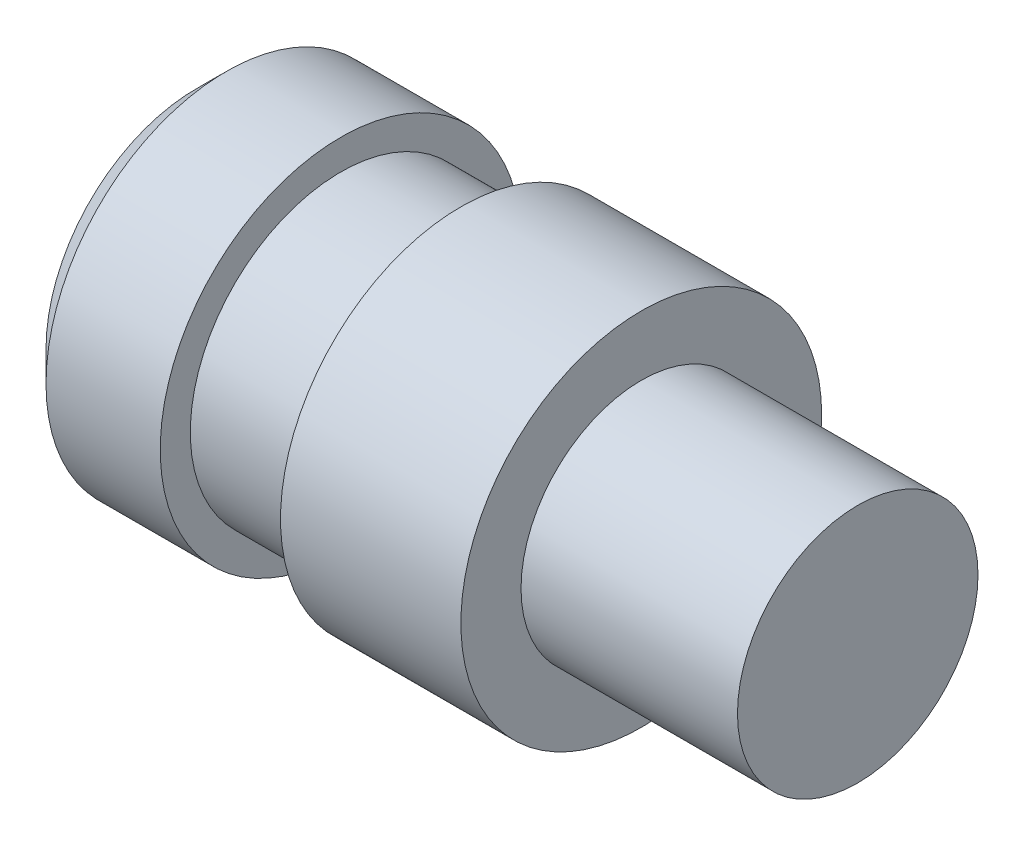
ISO-10303-21;
HEADER;
FILE_DESCRIPTION(('STEP AP214'),'2;1');
FILE_NAME('part.step','',(''),(''),'','','');
FILE_SCHEMA(('AUTOMOTIVE_DESIGN { 1 0 10303 214 1 1 1 1 }'));
ENDSEC;
DATA;
#1=APPLICATION_CONTEXT('core data for automotive mechanical design processes');
#2=APPLICATION_PROTOCOL_DEFINITION('international standard','automotive_design',2000,#1);
#3=PRODUCT_CONTEXT('',#1,'mechanical');
#4=PRODUCT('Part','Part','',(#3));
#5=PRODUCT_RELATED_PRODUCT_CATEGORY('part','',(#4));
#6=PRODUCT_DEFINITION_FORMATION('','',#4);
#7=PRODUCT_DEFINITION_CONTEXT('part definition',#1,'design');
#8=PRODUCT_DEFINITION('design','',#6,#7);
#9=PRODUCT_DEFINITION_SHAPE('','',#8);
#10=(LENGTH_UNIT() NAMED_UNIT(*) SI_UNIT(.MILLI.,.METRE.));
#11=(NAMED_UNIT(*) PLANE_ANGLE_UNIT() SI_UNIT($,.RADIAN.));
#12=(NAMED_UNIT(*) SI_UNIT($,.STERADIAN.) SOLID_ANGLE_UNIT());
#13=UNCERTAINTY_MEASURE_WITH_UNIT(LENGTH_MEASURE(1.E-05),#10,'distance_accuracy_value','');
#14=(GEOMETRIC_REPRESENTATION_CONTEXT(3) GLOBAL_UNCERTAINTY_ASSIGNED_CONTEXT((#13)) GLOBAL_UNIT_ASSIGNED_CONTEXT((#10,
#11,#12)) REPRESENTATION_CONTEXT('',''));
#15=CARTESIAN_POINT('',(0.,0.,0.));
#16=DIRECTION('',(0.,0.,1.));
#17=DIRECTION('',(1.,0.,0.));
#18=AXIS2_PLACEMENT_3D('',#15,#16,#17);
#19=CARTESIAN_POINT('',(0.,0.,0.));
#20=DIRECTION('',(-1.,0.,0.));
#21=DIRECTION('',(0.,0.,1.));
#22=AXIS2_PLACEMENT_3D('',#19,#20,#21);
#23=PLANE('',#22);
#24=CARTESIAN_POINT('',(0.,0.,0.));
#25=DIRECTION('',(-1.,0.,0.));
#26=DIRECTION('',(0.,0.,1.));
#27=AXIS2_PLACEMENT_3D('',#24,#25,#26);
#28=CIRCLE('',#27,2.5);
#29=CARTESIAN_POINT('',(0.,0.,2.5));
#30=VERTEX_POINT('',#29);
#31=EDGE_CURVE('E10',#30,#30,#28,.T.);
#32=ORIENTED_EDGE('',*,*,#31,.T.);
#33=EDGE_LOOP('',(#32));
#34=FACE_BOUND('',#33,.T.);
#35=ADVANCED_FACE('F35',(#34),#23,.T.);
#36=CARTESIAN_POINT('',(11.,0.,0.));
#37=DIRECTION('',(1.,0.,0.));
#38=DIRECTION('',(0.,0.,-1.));
#39=AXIS2_PLACEMENT_3D('',#36,#37,#38);
#40=CYLINDRICAL_SURFACE('',#39,3.);
#41=CARTESIAN_POINT('',(0.499999999999999,0.,0.));
#42=DIRECTION('',(-1.,0.,0.));
#43=DIRECTION('',(0.,0.,1.));
#44=AXIS2_PLACEMENT_3D('',#41,#42,#43);
#45=CIRCLE('',#44,3.);
#46=CARTESIAN_POINT('',(0.499999999999999,0.,3.));
#47=VERTEX_POINT('',#46);
#48=EDGE_CURVE('E42',#47,#47,#45,.F.);
#49=ORIENTED_EDGE('',*,*,#48,.T.);
#50=EDGE_LOOP('',(#49));
#51=FACE_BOUND('',#50,.T.);
#52=CARTESIAN_POINT('',(2.4,0.,0.));
#53=DIRECTION('',(1.,0.,0.));
#54=DIRECTION('',(0.,0.,-1.));
#55=AXIS2_PLACEMENT_3D('',#52,#53,#54);
#56=CIRCLE('',#55,3.);
#57=CARTESIAN_POINT('',(2.4,0.,-3.));
#58=VERTEX_POINT('',#57);
#59=EDGE_CURVE('E46',#58,#58,#56,.T.);
#60=ORIENTED_EDGE('',*,*,#59,.F.);
#61=EDGE_LOOP('',(#60));
#62=FACE_BOUND('',#61,.T.);
#63=ADVANCED_FACE('F87',(#51,#62),#40,.T.);
#64=CARTESIAN_POINT('',(2.4,3.,0.));
#65=DIRECTION('',(1.,0.,0.));
#66=DIRECTION('',(0.,0.,-1.));
#67=AXIS2_PLACEMENT_3D('',#64,#65,#66);
#68=PLANE('',#67);
#69=ORIENTED_EDGE('',*,*,#59,.T.);
#70=EDGE_LOOP('',(#69));
#71=FACE_BOUND('',#70,.T.);
#72=CARTESIAN_POINT('',(2.4,0.,0.));
#73=DIRECTION('',(1.,0.,0.));
#74=DIRECTION('',(0.,0.,-1.));
#75=AXIS2_PLACEMENT_3D('',#72,#73,#74);
#76=CIRCLE('',#75,2.5);
#77=CARTESIAN_POINT('',(2.4,0.,-2.5));
#78=VERTEX_POINT('',#77);
#79=EDGE_CURVE('E50',#78,#78,#76,.T.);
#80=ORIENTED_EDGE('',*,*,#79,.F.);
#81=EDGE_LOOP('',(#80));
#82=FACE_BOUND('',#81,.T.);
#83=ADVANCED_FACE('F91',(#71,#82),#68,.T.);
#84=CARTESIAN_POINT('',(11.,0.,0.));
#85=DIRECTION('',(1.,0.,0.));
#86=DIRECTION('',(0.,0.,-1.));
#87=AXIS2_PLACEMENT_3D('',#84,#85,#86);
#88=CYLINDRICAL_SURFACE('',#87,2.5);
#89=ORIENTED_EDGE('',*,*,#79,.T.);
#90=EDGE_LOOP('',(#89));
#91=FACE_BOUND('',#90,.T.);
#92=CARTESIAN_POINT('',(4.4,0.,0.));
#93=DIRECTION('',(1.,0.,0.));
#94=DIRECTION('',(0.,0.,-1.));
#95=AXIS2_PLACEMENT_3D('',#92,#93,#94);
#96=CIRCLE('',#95,2.5);
#97=CARTESIAN_POINT('',(4.4,0.,-2.5));
#98=VERTEX_POINT('',#97);
#99=EDGE_CURVE('E55',#98,#98,#96,.T.);
#100=ORIENTED_EDGE('',*,*,#99,.F.);
#101=EDGE_LOOP('',(#100));
#102=FACE_BOUND('',#101,.T.);
#103=ADVANCED_FACE('F96',(#91,#102),#88,.T.);
#104=CARTESIAN_POINT('',(4.4,2.5,0.));
#105=DIRECTION('',(-1.,0.,0.));
#106=DIRECTION('',(0.,0.,1.));
#107=AXIS2_PLACEMENT_3D('',#104,#105,#106);
#108=PLANE('',#107);
#109=ORIENTED_EDGE('',*,*,#99,.T.);
#110=EDGE_LOOP('',(#109));
#111=FACE_BOUND('',#110,.T.);
#112=CARTESIAN_POINT('',(4.4,0.,0.));
#113=DIRECTION('',(1.,0.,0.));
#114=DIRECTION('',(0.,0.,-1.));
#115=AXIS2_PLACEMENT_3D('',#112,#113,#114);
#116=CIRCLE('',#115,3.);
#117=CARTESIAN_POINT('',(4.4,0.,-3.));
#118=VERTEX_POINT('',#117);
#119=EDGE_CURVE('E58',#118,#118,#116,.T.);
#120=ORIENTED_EDGE('',*,*,#119,.F.);
#121=EDGE_LOOP('',(#120));
#122=FACE_BOUND('',#121,.T.);
#123=ADVANCED_FACE('F100',(#111,#122),#108,.T.);
#124=CARTESIAN_POINT('',(11.,0.,0.));
#125=DIRECTION('',(1.,0.,0.));
#126=DIRECTION('',(0.,0.,-1.));
#127=AXIS2_PLACEMENT_3D('',#124,#125,#126);
#128=CYLINDRICAL_SURFACE('',#127,3.);
#129=ORIENTED_EDGE('',*,*,#119,.T.);
#130=EDGE_LOOP('',(#129));
#131=FACE_BOUND('',#130,.T.);
#132=CARTESIAN_POINT('',(7.4,0.,0.));
#133=DIRECTION('',(1.,0.,0.));
#134=DIRECTION('',(0.,0.,-1.));
#135=AXIS2_PLACEMENT_3D('',#132,#133,#134);
#136=CIRCLE('',#135,3.);
#137=CARTESIAN_POINT('',(7.4,0.,-3.));
#138=VERTEX_POINT('',#137);
#139=EDGE_CURVE('E61',#138,#138,#136,.T.);
#140=ORIENTED_EDGE('',*,*,#139,.F.);
#141=EDGE_LOOP('',(#140));
#142=FACE_BOUND('',#141,.T.);
#143=ADVANCED_FACE('F83',(#131,#142),#128,.T.);
#144=CARTESIAN_POINT('',(7.4,3.,0.));
#145=DIRECTION('',(1.,0.,0.));
#146=DIRECTION('',(0.,0.,-1.));
#147=AXIS2_PLACEMENT_3D('',#144,#145,#146);
#148=PLANE('',#147);
#149=ORIENTED_EDGE('',*,*,#139,.T.);
#150=EDGE_LOOP('',(#149));
#151=FACE_BOUND('',#150,.T.);
#152=CARTESIAN_POINT('',(7.4,0.,0.));
#153=DIRECTION('',(1.,0.,0.));
#154=DIRECTION('',(0.,0.,-1.));
#155=AXIS2_PLACEMENT_3D('',#152,#153,#154);
#156=CIRCLE('',#155,2.);
#157=CARTESIAN_POINT('',(7.4,0.,-2.));
#158=VERTEX_POINT('',#157);
#159=EDGE_CURVE('E64',#158,#158,#156,.T.);
#160=ORIENTED_EDGE('',*,*,#159,.F.);
#161=EDGE_LOOP('',(#160));
#162=FACE_BOUND('',#161,.T.);
#163=ADVANCED_FACE('F75',(#151,#162),#148,.T.);
#164=CARTESIAN_POINT('',(11.,0.,0.));
#165=DIRECTION('',(1.,0.,0.));
#166=DIRECTION('',(0.,0.,-1.));
#167=AXIS2_PLACEMENT_3D('',#164,#165,#166);
#168=CYLINDRICAL_SURFACE('',#167,2.);
#169=ORIENTED_EDGE('',*,*,#159,.T.);
#170=EDGE_LOOP('',(#169));
#171=FACE_BOUND('',#170,.T.);
#172=CARTESIAN_POINT('',(11.,0.,0.));
#173=DIRECTION('',(1.,0.,0.));
#174=DIRECTION('',(0.,0.,-1.));
#175=AXIS2_PLACEMENT_3D('',#172,#173,#174);
#176=CIRCLE('',#175,2.);
#177=CARTESIAN_POINT('',(11.,0.,-2.));
#178=VERTEX_POINT('',#177);
#179=EDGE_CURVE('E67',#178,#178,#176,.T.);
#180=ORIENTED_EDGE('',*,*,#179,.F.);
#181=EDGE_LOOP('',(#180));
#182=FACE_BOUND('',#181,.T.);
#183=ADVANCED_FACE('F73',(#171,#182),#168,.T.);
#184=CARTESIAN_POINT('',(11.,2.,0.));
#185=DIRECTION('',(1.,0.,0.));
#186=DIRECTION('',(0.,0.,-1.));
#187=AXIS2_PLACEMENT_3D('',#184,#185,#186);
#188=PLANE('',#187);
#189=ORIENTED_EDGE('',*,*,#179,.T.);
#190=EDGE_LOOP('',(#189));
#191=FACE_BOUND('',#190,.T.);
#192=ADVANCED_FACE('F71',(#191),#188,.T.);
#193=CARTESIAN_POINT('',(0.499999999999999,0.,0.));
#194=DIRECTION('',(1.,0.,0.));
#195=DIRECTION('',(0.,0.,-1.));
#196=AXIS2_PLACEMENT_3D('',#193,#194,#195);
#197=CONICAL_SURFACE('',#196,3.,0.78539816339745);
#198=ORIENTED_EDGE('',*,*,#31,.F.);
#199=EDGE_LOOP('',(#198));
#200=FACE_BOUND('',#199,.T.);
#201=ORIENTED_EDGE('',*,*,#48,.F.);
#202=EDGE_LOOP('',(#201));
#203=FACE_BOUND('',#202,.T.);
#204=ADVANCED_FACE('F37',(#200,#203),#197,.T.);
#205=CLOSED_SHELL('',(#35,#63,#83,#103,#123,#143,#163,#183,#192,#204));
#206=MANIFOLD_SOLID_BREP('B2',#205);
#207=ADVANCED_BREP_SHAPE_REPRESENTATION('',(#18,#206),#14);
#208=SHAPE_DEFINITION_REPRESENTATION(#9,#207);
ENDSEC;
END-ISO-10303-21;
